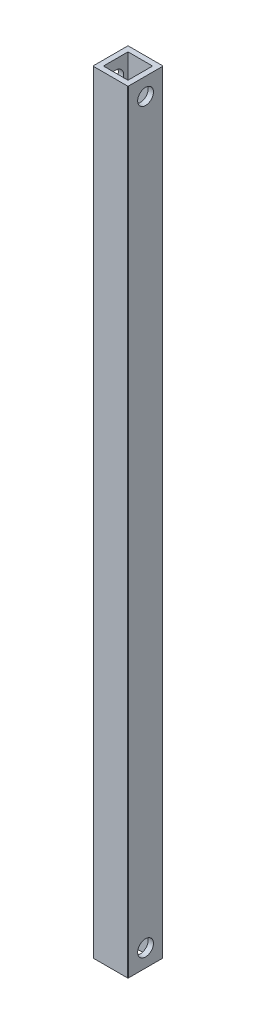
ISO-10303-21;
HEADER;
FILE_DESCRIPTION(('STEP AP214'),'2;1');
FILE_NAME('part.step','',(''),(''),'','','');
FILE_SCHEMA(('AUTOMOTIVE_DESIGN { 1 0 10303 214 1 1 1 1 }'));
ENDSEC;
DATA;
#1=APPLICATION_CONTEXT('core data for automotive mechanical design processes');
#2=APPLICATION_PROTOCOL_DEFINITION('international standard','automotive_design',2000,#1);
#3=PRODUCT_CONTEXT('',#1,'mechanical');
#4=PRODUCT('Part','Part','',(#3));
#5=PRODUCT_RELATED_PRODUCT_CATEGORY('part','',(#4));
#6=PRODUCT_DEFINITION_FORMATION('','',#4);
#7=PRODUCT_DEFINITION_CONTEXT('part definition',#1,'design');
#8=PRODUCT_DEFINITION('design','',#6,#7);
#9=PRODUCT_DEFINITION_SHAPE('','',#8);
#10=(LENGTH_UNIT() NAMED_UNIT(*) SI_UNIT(.MILLI.,.METRE.));
#11=(NAMED_UNIT(*) PLANE_ANGLE_UNIT() SI_UNIT($,.RADIAN.));
#12=(NAMED_UNIT(*) SI_UNIT($,.STERADIAN.) SOLID_ANGLE_UNIT());
#13=UNCERTAINTY_MEASURE_WITH_UNIT(LENGTH_MEASURE(1.E-05),#10,'distance_accuracy_value','');
#14=(GEOMETRIC_REPRESENTATION_CONTEXT(3) GLOBAL_UNCERTAINTY_ASSIGNED_CONTEXT((#13)) GLOBAL_UNIT_ASSIGNED_CONTEXT((#10,
#11,#12)) REPRESENTATION_CONTEXT('',''));
#15=CARTESIAN_POINT('',(0.,0.,0.));
#16=DIRECTION('',(0.,0.,1.));
#17=DIRECTION('',(1.,0.,0.));
#18=AXIS2_PLACEMENT_3D('',#15,#16,#17);
#19=CARTESIAN_POINT('',(0.,220.,0.));
#20=DIRECTION('',(0.,1.,0.));
#21=DIRECTION('',(0.,0.,1.));
#22=AXIS2_PLACEMENT_3D('',#19,#20,#21);
#23=PLANE('',#22);
#24=DIRECTION('',(0.,0.,1.));
#25=VECTOR('',#24,1.);
#26=CARTESIAN_POINT('',(-5.,220.,5.));
#27=LINE('',#26,#25);
#28=CARTESIAN_POINT('',(-5.,220.,-4.8));
#29=VERTEX_POINT('',#28);
#30=CARTESIAN_POINT('',(-5.,220.,4.8));
#31=VERTEX_POINT('',#30);
#32=EDGE_CURVE('E211',#29,#31,#27,.T.);
#33=ORIENTED_EDGE('',*,*,#32,.T.);
#34=CARTESIAN_POINT('',(-4.8,220.,4.8));
#35=DIRECTION('',(0.,1.,0.));
#36=DIRECTION('',(0.,0.,1.));
#37=AXIS2_PLACEMENT_3D('',#34,#35,#36);
#38=CIRCLE('',#37,0.2);
#39=CARTESIAN_POINT('',(-4.8,220.,5.));
#40=VERTEX_POINT('',#39);
#41=EDGE_CURVE('E283',#31,#40,#38,.T.);
#42=ORIENTED_EDGE('',*,*,#41,.T.);
#43=DIRECTION('',(1.,0.,0.));
#44=VECTOR('',#43,1.);
#45=CARTESIAN_POINT('',(5.,220.,5.));
#46=LINE('',#45,#44);
#47=CARTESIAN_POINT('',(4.8,220.,5.));
#48=VERTEX_POINT('',#47);
#49=EDGE_CURVE('E215',#40,#48,#46,.T.);
#50=ORIENTED_EDGE('',*,*,#49,.T.);
#51=CARTESIAN_POINT('',(4.8,220.,4.8));
#52=DIRECTION('',(0.,1.,0.));
#53=DIRECTION('',(0.,0.,1.));
#54=AXIS2_PLACEMENT_3D('',#51,#52,#53);
#55=CIRCLE('',#54,0.2);
#56=CARTESIAN_POINT('',(5.,220.,4.8));
#57=VERTEX_POINT('',#56);
#58=EDGE_CURVE('E280',#48,#57,#55,.T.);
#59=ORIENTED_EDGE('',*,*,#58,.T.);
#60=DIRECTION('',(0.,0.,-1.));
#61=VECTOR('',#60,1.);
#62=CARTESIAN_POINT('',(5.,220.,5.));
#63=LINE('',#62,#61);
#64=CARTESIAN_POINT('',(5.,220.,-4.8));
#65=VERTEX_POINT('',#64);
#66=EDGE_CURVE('E220',#57,#65,#63,.T.);
#67=ORIENTED_EDGE('',*,*,#66,.T.);
#68=CARTESIAN_POINT('',(4.8,220.,-4.8));
#69=DIRECTION('',(0.,1.,0.));
#70=DIRECTION('',(0.,0.,1.));
#71=AXIS2_PLACEMENT_3D('',#68,#69,#70);
#72=CIRCLE('',#71,0.2);
#73=CARTESIAN_POINT('',(4.8,220.,-5.));
#74=VERTEX_POINT('',#73);
#75=EDGE_CURVE('E86',#65,#74,#72,.T.);
#76=ORIENTED_EDGE('',*,*,#75,.T.);
#77=DIRECTION('',(-1.,0.,0.));
#78=VECTOR('',#77,1.);
#79=CARTESIAN_POINT('',(5.,220.,-5.));
#80=LINE('',#79,#78);
#81=CARTESIAN_POINT('',(-4.8,220.,-5.));
#82=VERTEX_POINT('',#81);
#83=EDGE_CURVE('E223',#74,#82,#80,.T.);
#84=ORIENTED_EDGE('',*,*,#83,.T.);
#85=CARTESIAN_POINT('',(-4.8,220.,-4.8));
#86=DIRECTION('',(0.,1.,0.));
#87=DIRECTION('',(0.,0.,1.));
#88=AXIS2_PLACEMENT_3D('',#85,#86,#87);
#89=CIRCLE('',#88,0.2);
#90=EDGE_CURVE('E277',#82,#29,#89,.T.);
#91=ORIENTED_EDGE('',*,*,#90,.T.);
#92=EDGE_LOOP('',(#33,#42,#50,#59,#67,#76,#84,#91));
#93=FACE_BOUND('',#92,.T.);
#94=DIRECTION('',(1.,0.,0.));
#95=VECTOR('',#94,1.);
#96=CARTESIAN_POINT('',(5.,220.,3.5));
#97=LINE('',#96,#95);
#98=CARTESIAN_POINT('',(-3.5,220.,3.5));
#99=VERTEX_POINT('',#98);
#100=CARTESIAN_POINT('',(3.5,220.,3.5));
#101=VERTEX_POINT('',#100);
#102=EDGE_CURVE('E167',#99,#101,#97,.T.);
#103=ORIENTED_EDGE('',*,*,#102,.F.);
#104=DIRECTION('',(0.,0.,1.));
#105=VECTOR('',#104,1.);
#106=CARTESIAN_POINT('',(-3.5,220.,5.));
#107=LINE('',#106,#105);
#108=CARTESIAN_POINT('',(-3.5,220.,-3.5));
#109=VERTEX_POINT('',#108);
#110=EDGE_CURVE('E156',#109,#99,#107,.T.);
#111=ORIENTED_EDGE('',*,*,#110,.F.);
#112=DIRECTION('',(-1.,0.,0.));
#113=VECTOR('',#112,1.);
#114=CARTESIAN_POINT('',(5.,220.,-3.5));
#115=LINE('',#114,#113);
#116=CARTESIAN_POINT('',(3.5,220.,-3.5));
#117=VERTEX_POINT('',#116);
#118=EDGE_CURVE('E185',#117,#109,#115,.T.);
#119=ORIENTED_EDGE('',*,*,#118,.F.);
#120=DIRECTION('',(0.,0.,-1.));
#121=VECTOR('',#120,1.);
#122=CARTESIAN_POINT('',(3.5,220.,5.));
#123=LINE('',#122,#121);
#124=EDGE_CURVE('E181',#101,#117,#123,.T.);
#125=ORIENTED_EDGE('',*,*,#124,.F.);
#126=EDGE_LOOP('',(#103,#111,#119,#125));
#127=FACE_BOUND('',#126,.T.);
#128=ADVANCED_FACE('F65',(#93,#127),#23,.T.);
#129=CARTESIAN_POINT('',(0.,0.,0.));
#130=DIRECTION('',(0.,1.,0.));
#131=DIRECTION('',(0.,0.,1.));
#132=AXIS2_PLACEMENT_3D('',#129,#130,#131);
#133=PLANE('',#132);
#134=DIRECTION('',(1.,0.,0.));
#135=VECTOR('',#134,1.);
#136=CARTESIAN_POINT('',(5.,0.,5.));
#137=LINE('',#136,#135);
#138=CARTESIAN_POINT('',(-4.8,0.,5.));
#139=VERTEX_POINT('',#138);
#140=CARTESIAN_POINT('',(4.8,0.,5.));
#141=VERTEX_POINT('',#140);
#142=EDGE_CURVE('E230',#139,#141,#137,.T.);
#143=ORIENTED_EDGE('',*,*,#142,.F.);
#144=CARTESIAN_POINT('',(-4.8,0.,4.8));
#145=DIRECTION('',(0.,1.,0.));
#146=DIRECTION('',(0.,0.,1.));
#147=AXIS2_PLACEMENT_3D('',#144,#145,#146);
#148=CIRCLE('',#147,0.2);
#149=CARTESIAN_POINT('',(-5.,0.,4.8));
#150=VERTEX_POINT('',#149);
#151=EDGE_CURVE('E265',#139,#150,#148,.F.);
#152=ORIENTED_EDGE('',*,*,#151,.T.);
#153=DIRECTION('',(0.,0.,1.));
#154=VECTOR('',#153,1.);
#155=CARTESIAN_POINT('',(-5.,0.,5.));
#156=LINE('',#155,#154);
#157=CARTESIAN_POINT('',(-5.,0.,-4.8));
#158=VERTEX_POINT('',#157);
#159=EDGE_CURVE('E176',#158,#150,#156,.T.);
#160=ORIENTED_EDGE('',*,*,#159,.F.);
#161=CARTESIAN_POINT('',(-4.8,0.,-4.8));
#162=DIRECTION('',(0.,1.,0.));
#163=DIRECTION('',(0.,0.,1.));
#164=AXIS2_PLACEMENT_3D('',#161,#162,#163);
#165=CIRCLE('',#164,0.2);
#166=CARTESIAN_POINT('',(-4.8,0.,-5.));
#167=VERTEX_POINT('',#166);
#168=EDGE_CURVE('E259',#158,#167,#165,.F.);
#169=ORIENTED_EDGE('',*,*,#168,.T.);
#170=DIRECTION('',(-1.,0.,0.));
#171=VECTOR('',#170,1.);
#172=CARTESIAN_POINT('',(5.,0.,-5.));
#173=LINE('',#172,#171);
#174=CARTESIAN_POINT('',(4.8,0.,-5.));
#175=VERTEX_POINT('',#174);
#176=EDGE_CURVE('E216',#175,#167,#173,.T.);
#177=ORIENTED_EDGE('',*,*,#176,.F.);
#178=CARTESIAN_POINT('',(4.8,0.,-4.8));
#179=DIRECTION('',(0.,1.,0.));
#180=DIRECTION('',(0.,0.,1.));
#181=AXIS2_PLACEMENT_3D('',#178,#179,#180);
#182=CIRCLE('',#181,0.2);
#183=CARTESIAN_POINT('',(5.,0.,-4.8));
#184=VERTEX_POINT('',#183);
#185=EDGE_CURVE('E256',#175,#184,#182,.F.);
#186=ORIENTED_EDGE('',*,*,#185,.T.);
#187=DIRECTION('',(0.,0.,-1.));
#188=VECTOR('',#187,1.);
#189=CARTESIAN_POINT('',(5.,0.,5.));
#190=LINE('',#189,#188);
#191=CARTESIAN_POINT('',(5.,0.,4.8));
#192=VERTEX_POINT('',#191);
#193=EDGE_CURVE('E234',#192,#184,#190,.T.);
#194=ORIENTED_EDGE('',*,*,#193,.F.);
#195=CARTESIAN_POINT('',(4.8,0.,4.8));
#196=DIRECTION('',(0.,1.,0.));
#197=DIRECTION('',(0.,0.,1.));
#198=AXIS2_PLACEMENT_3D('',#195,#196,#197);
#199=CIRCLE('',#198,0.2);
#200=EDGE_CURVE('E262',#192,#141,#199,.F.);
#201=ORIENTED_EDGE('',*,*,#200,.T.);
#202=EDGE_LOOP('',(#143,#152,#160,#169,#177,#186,#194,#201));
#203=FACE_BOUND('',#202,.T.);
#204=DIRECTION('',(0.,0.,1.));
#205=VECTOR('',#204,1.);
#206=CARTESIAN_POINT('',(-3.5,0.,5.));
#207=LINE('',#206,#205);
#208=CARTESIAN_POINT('',(-3.5,0.,-3.5));
#209=VERTEX_POINT('',#208);
#210=CARTESIAN_POINT('',(-3.5,0.,3.5));
#211=VERTEX_POINT('',#210);
#212=EDGE_CURVE('E191',#209,#211,#207,.T.);
#213=ORIENTED_EDGE('',*,*,#212,.T.);
#214=DIRECTION('',(1.,0.,0.));
#215=VECTOR('',#214,1.);
#216=CARTESIAN_POINT('',(5.,0.,3.5));
#217=LINE('',#216,#215);
#218=CARTESIAN_POINT('',(3.5,0.,3.5));
#219=VERTEX_POINT('',#218);
#220=EDGE_CURVE('E174',#211,#219,#217,.T.);
#221=ORIENTED_EDGE('',*,*,#220,.T.);
#222=DIRECTION('',(0.,0.,-1.));
#223=VECTOR('',#222,1.);
#224=CARTESIAN_POINT('',(3.5,0.,5.));
#225=LINE('',#224,#223);
#226=CARTESIAN_POINT('',(3.5,0.,-3.5));
#227=VERTEX_POINT('',#226);
#228=EDGE_CURVE('E197',#219,#227,#225,.T.);
#229=ORIENTED_EDGE('',*,*,#228,.T.);
#230=DIRECTION('',(-1.,0.,0.));
#231=VECTOR('',#230,1.);
#232=CARTESIAN_POINT('',(5.,0.,-3.5));
#233=LINE('',#232,#231);
#234=EDGE_CURVE('E168',#227,#209,#233,.T.);
#235=ORIENTED_EDGE('',*,*,#234,.T.);
#236=EDGE_LOOP('',(#213,#221,#229,#235));
#237=FACE_BOUND('',#236,.T.);
#238=ADVANCED_FACE('F300',(#203,#237),#133,.F.);
#239=CARTESIAN_POINT('',(-5.,220.,5.));
#240=DIRECTION('',(1.,0.,0.));
#241=DIRECTION('',(0.,0.,-1.));
#242=AXIS2_PLACEMENT_3D('',#239,#240,#241);
#243=PLANE('',#242);
#244=CARTESIAN_POINT('',(-5.,215.,0.));
#245=DIRECTION('',(1.,0.,0.));
#246=DIRECTION('',(0.,0.,-1.));
#247=AXIS2_PLACEMENT_3D('',#244,#245,#246);
#248=CIRCLE('',#247,2.25);
#249=CARTESIAN_POINT('',(-5.,215.,-2.25));
#250=VERTEX_POINT('',#249);
#251=EDGE_CURVE('E245',#250,#250,#248,.T.);
#252=ORIENTED_EDGE('',*,*,#251,.T.);
#253=EDGE_LOOP('',(#252));
#254=FACE_BOUND('',#253,.T.);
#255=CARTESIAN_POINT('',(-5.,5.,0.));
#256=DIRECTION('',(1.,0.,0.));
#257=DIRECTION('',(0.,0.,1.));
#258=AXIS2_PLACEMENT_3D('',#255,#256,#257);
#259=CIRCLE('',#258,2.25);
#260=CARTESIAN_POINT('',(-5.,5.,2.25));
#261=VERTEX_POINT('',#260);
#262=EDGE_CURVE('E491',#261,#261,#259,.T.);
#263=ORIENTED_EDGE('',*,*,#262,.T.);
#264=EDGE_LOOP('',(#263));
#265=FACE_BOUND('',#264,.T.);
#266=ORIENTED_EDGE('',*,*,#159,.T.);
#267=DIRECTION('',(0.,-1.,0.));
#268=VECTOR('',#267,1.);
#269=CARTESIAN_POINT('',(-5.,220.,4.8));
#270=LINE('',#269,#268);
#271=EDGE_CURVE('E272',#150,#31,#270,.F.);
#272=ORIENTED_EDGE('',*,*,#271,.T.);
#273=ORIENTED_EDGE('',*,*,#32,.F.);
#274=DIRECTION('',(0.,-1.,0.));
#275=VECTOR('',#274,1.);
#276=CARTESIAN_POINT('',(-5.,220.,-4.8));
#277=LINE('',#276,#275);
#278=EDGE_CURVE('E268',#29,#158,#277,.T.);
#279=ORIENTED_EDGE('',*,*,#278,.T.);
#280=EDGE_LOOP('',(#266,#272,#273,#279));
#281=FACE_BOUND('',#280,.T.);
#282=ADVANCED_FACE('F310',(#254,#265,#281),#243,.F.);
#283=CARTESIAN_POINT('',(5.,220.,5.));
#284=DIRECTION('',(0.,0.,-1.));
#285=DIRECTION('',(-1.,0.,0.));
#286=AXIS2_PLACEMENT_3D('',#283,#284,#285);
#287=PLANE('',#286);
#288=ORIENTED_EDGE('',*,*,#49,.F.);
#289=DIRECTION('',(0.,-1.,0.));
#290=VECTOR('',#289,1.);
#291=CARTESIAN_POINT('',(-4.8,220.,5.));
#292=LINE('',#291,#290);
#293=EDGE_CURVE('E252',#40,#139,#292,.T.);
#294=ORIENTED_EDGE('',*,*,#293,.T.);
#295=ORIENTED_EDGE('',*,*,#142,.T.);
#296=DIRECTION('',(0.,-1.,0.));
#297=VECTOR('',#296,1.);
#298=CARTESIAN_POINT('',(4.8,220.,5.));
#299=LINE('',#298,#297);
#300=EDGE_CURVE('E226',#141,#48,#299,.F.);
#301=ORIENTED_EDGE('',*,*,#300,.T.);
#302=EDGE_LOOP('',(#288,#294,#295,#301));
#303=FACE_BOUND('',#302,.T.);
#304=ADVANCED_FACE('F318',(#303),#287,.F.);
#305=CARTESIAN_POINT('',(5.,220.,5.));
#306=DIRECTION('',(-1.,0.,0.));
#307=DIRECTION('',(0.,0.,1.));
#308=AXIS2_PLACEMENT_3D('',#305,#306,#307);
#309=PLANE('',#308);
#310=CARTESIAN_POINT('',(5.,215.,0.));
#311=DIRECTION('',(1.,0.,0.));
#312=DIRECTION('',(0.,0.,-1.));
#313=AXIS2_PLACEMENT_3D('',#310,#311,#312);
#314=CIRCLE('',#313,2.25);
#315=CARTESIAN_POINT('',(5.,215.,-2.25));
#316=VERTEX_POINT('',#315);
#317=EDGE_CURVE('E498',#316,#316,#314,.T.);
#318=ORIENTED_EDGE('',*,*,#317,.F.);
#319=EDGE_LOOP('',(#318));
#320=FACE_BOUND('',#319,.T.);
#321=CARTESIAN_POINT('',(5.,5.,0.));
#322=DIRECTION('',(1.,0.,0.));
#323=DIRECTION('',(0.,0.,1.));
#324=AXIS2_PLACEMENT_3D('',#321,#322,#323);
#325=CIRCLE('',#324,2.25);
#326=CARTESIAN_POINT('',(5.,5.,2.25));
#327=VERTEX_POINT('',#326);
#328=EDGE_CURVE('E503',#327,#327,#325,.T.);
#329=ORIENTED_EDGE('',*,*,#328,.F.);
#330=EDGE_LOOP('',(#329));
#331=FACE_BOUND('',#330,.T.);
#332=ORIENTED_EDGE('',*,*,#66,.F.);
#333=DIRECTION('',(0.,-1.,0.));
#334=VECTOR('',#333,1.);
#335=CARTESIAN_POINT('',(5.,220.,4.8));
#336=LINE('',#335,#334);
#337=EDGE_CURVE('E289',#57,#192,#336,.T.);
#338=ORIENTED_EDGE('',*,*,#337,.T.);
#339=ORIENTED_EDGE('',*,*,#193,.T.);
#340=DIRECTION('',(0.,-1.,0.));
#341=VECTOR('',#340,1.);
#342=CARTESIAN_POINT('',(5.,220.,-4.8));
#343=LINE('',#342,#341);
#344=EDGE_CURVE('E286',#184,#65,#343,.F.);
#345=ORIENTED_EDGE('',*,*,#344,.T.);
#346=EDGE_LOOP('',(#332,#338,#339,#345));
#347=FACE_BOUND('',#346,.T.);
#348=ADVANCED_FACE('F326',(#320,#331,#347),#309,.F.);
#349=CARTESIAN_POINT('',(5.,220.,-5.));
#350=DIRECTION('',(0.,0.,1.));
#351=DIRECTION('',(1.,0.,0.));
#352=AXIS2_PLACEMENT_3D('',#349,#350,#351);
#353=PLANE('',#352);
#354=ORIENTED_EDGE('',*,*,#176,.T.);
#355=DIRECTION('',(0.,-1.,0.));
#356=VECTOR('',#355,1.);
#357=CARTESIAN_POINT('',(-4.8,220.,-5.));
#358=LINE('',#357,#356);
#359=EDGE_CURVE('E12',#167,#82,#358,.F.);
#360=ORIENTED_EDGE('',*,*,#359,.T.);
#361=ORIENTED_EDGE('',*,*,#83,.F.);
#362=DIRECTION('',(0.,-1.,0.));
#363=VECTOR('',#362,1.);
#364=CARTESIAN_POINT('',(4.8,220.,-5.));
#365=LINE('',#364,#363);
#366=EDGE_CURVE('E74',#74,#175,#365,.T.);
#367=ORIENTED_EDGE('',*,*,#366,.T.);
#368=EDGE_LOOP('',(#354,#360,#361,#367));
#369=FACE_BOUND('',#368,.T.);
#370=ADVANCED_FACE('F296',(#369),#353,.F.);
#371=CARTESIAN_POINT('',(-3.5,220.,5.));
#372=DIRECTION('',(1.,0.,0.));
#373=DIRECTION('',(0.,0.,-1.));
#374=AXIS2_PLACEMENT_3D('',#371,#372,#373);
#375=PLANE('',#374);
#376=CARTESIAN_POINT('',(-3.5,215.,0.));
#377=DIRECTION('',(1.,0.,0.));
#378=DIRECTION('',(0.,0.,-1.));
#379=AXIS2_PLACEMENT_3D('',#376,#377,#378);
#380=CIRCLE('',#379,2.25);
#381=CARTESIAN_POINT('',(-3.5,215.,-2.25));
#382=VERTEX_POINT('',#381);
#383=EDGE_CURVE('E194',#382,#382,#380,.T.);
#384=ORIENTED_EDGE('',*,*,#383,.F.);
#385=EDGE_LOOP('',(#384));
#386=FACE_BOUND('',#385,.T.);
#387=CARTESIAN_POINT('',(-3.5,5.,0.));
#388=DIRECTION('',(1.,0.,0.));
#389=DIRECTION('',(0.,0.,-1.));
#390=AXIS2_PLACEMENT_3D('',#387,#388,#389);
#391=CIRCLE('',#390,2.25);
#392=CARTESIAN_POINT('',(-3.5,5.,-2.25));
#393=VERTEX_POINT('',#392);
#394=EDGE_CURVE('E244',#393,#393,#391,.T.);
#395=ORIENTED_EDGE('',*,*,#394,.F.);
#396=EDGE_LOOP('',(#395));
#397=FACE_BOUND('',#396,.T.);
#398=ORIENTED_EDGE('',*,*,#212,.F.);
#399=DIRECTION('',(0.,-1.,0.));
#400=VECTOR('',#399,1.);
#401=CARTESIAN_POINT('',(-3.5,220.,-3.5));
#402=LINE('',#401,#400);
#403=EDGE_CURVE('E162',#109,#209,#402,.T.);
#404=ORIENTED_EDGE('',*,*,#403,.F.);
#405=ORIENTED_EDGE('',*,*,#110,.T.);
#406=DIRECTION('',(0.,-1.,0.));
#407=VECTOR('',#406,1.);
#408=CARTESIAN_POINT('',(-3.5,220.,3.5));
#409=LINE('',#408,#407);
#410=EDGE_CURVE('E159',#99,#211,#409,.T.);
#411=ORIENTED_EDGE('',*,*,#410,.T.);
#412=EDGE_LOOP('',(#398,#404,#405,#411));
#413=FACE_BOUND('',#412,.T.);
#414=ADVANCED_FACE('F158',(#386,#397,#413),#375,.T.);
#415=CARTESIAN_POINT('',(5.,220.,3.5));
#416=DIRECTION('',(0.,0.,-1.));
#417=DIRECTION('',(-1.,0.,0.));
#418=AXIS2_PLACEMENT_3D('',#415,#416,#417);
#419=PLANE('',#418);
#420=ORIENTED_EDGE('',*,*,#220,.F.);
#421=ORIENTED_EDGE('',*,*,#410,.F.);
#422=ORIENTED_EDGE('',*,*,#102,.T.);
#423=DIRECTION('',(0.,-1.,0.));
#424=VECTOR('',#423,1.);
#425=CARTESIAN_POINT('',(3.5,220.,3.5));
#426=LINE('',#425,#424);
#427=EDGE_CURVE('E177',#101,#219,#426,.T.);
#428=ORIENTED_EDGE('',*,*,#427,.T.);
#429=EDGE_LOOP('',(#420,#421,#422,#428));
#430=FACE_BOUND('',#429,.T.);
#431=ADVANCED_FACE('F171',(#430),#419,.T.);
#432=CARTESIAN_POINT('',(3.5,220.,5.));
#433=DIRECTION('',(-1.,0.,0.));
#434=DIRECTION('',(0.,0.,1.));
#435=AXIS2_PLACEMENT_3D('',#432,#433,#434);
#436=PLANE('',#435);
#437=CARTESIAN_POINT('',(3.5,215.,0.));
#438=DIRECTION('',(-1.,0.,0.));
#439=DIRECTION('',(0.,0.,1.));
#440=AXIS2_PLACEMENT_3D('',#437,#438,#439);
#441=CIRCLE('',#440,2.25);
#442=CARTESIAN_POINT('',(3.5,215.,2.25));
#443=VERTEX_POINT('',#442);
#444=EDGE_CURVE('E246',#443,#443,#441,.T.);
#445=ORIENTED_EDGE('',*,*,#444,.F.);
#446=EDGE_LOOP('',(#445));
#447=FACE_BOUND('',#446,.T.);
#448=CARTESIAN_POINT('',(3.5,5.,0.));
#449=DIRECTION('',(-1.,0.,0.));
#450=DIRECTION('',(0.,0.,1.));
#451=AXIS2_PLACEMENT_3D('',#448,#449,#450);
#452=CIRCLE('',#451,2.25);
#453=CARTESIAN_POINT('',(3.5,5.,2.25));
#454=VERTEX_POINT('',#453);
#455=EDGE_CURVE('E240',#454,#454,#452,.T.);
#456=ORIENTED_EDGE('',*,*,#455,.F.);
#457=EDGE_LOOP('',(#456));
#458=FACE_BOUND('',#457,.T.);
#459=ORIENTED_EDGE('',*,*,#228,.F.);
#460=ORIENTED_EDGE('',*,*,#427,.F.);
#461=ORIENTED_EDGE('',*,*,#124,.T.);
#462=DIRECTION('',(0.,-1.,0.));
#463=VECTOR('',#462,1.);
#464=CARTESIAN_POINT('',(3.5,220.,-3.5));
#465=LINE('',#464,#463);
#466=EDGE_CURVE('E206',#117,#227,#465,.T.);
#467=ORIENTED_EDGE('',*,*,#466,.T.);
#468=EDGE_LOOP('',(#459,#460,#461,#467));
#469=FACE_BOUND('',#468,.T.);
#470=ADVANCED_FACE('F419',(#447,#458,#469),#436,.T.);
#471=CARTESIAN_POINT('',(5.,220.,-3.5));
#472=DIRECTION('',(0.,0.,1.));
#473=DIRECTION('',(1.,0.,0.));
#474=AXIS2_PLACEMENT_3D('',#471,#472,#473);
#475=PLANE('',#474);
#476=ORIENTED_EDGE('',*,*,#234,.F.);
#477=ORIENTED_EDGE('',*,*,#466,.F.);
#478=ORIENTED_EDGE('',*,*,#118,.T.);
#479=ORIENTED_EDGE('',*,*,#403,.T.);
#480=EDGE_LOOP('',(#476,#477,#478,#479));
#481=FACE_BOUND('',#480,.T.);
#482=ADVANCED_FACE('F410',(#481),#475,.T.);
#483=CARTESIAN_POINT('',(-5.,5.,0.));
#484=DIRECTION('',(1.,0.,0.));
#485=DIRECTION('',(0.,0.,-1.));
#486=AXIS2_PLACEMENT_3D('',#483,#484,#485);
#487=CYLINDRICAL_SURFACE('',#486,2.25);
#488=ORIENTED_EDGE('',*,*,#455,.T.);
#489=EDGE_LOOP('',(#488));
#490=FACE_BOUND('',#489,.T.);
#491=ORIENTED_EDGE('',*,*,#328,.T.);
#492=EDGE_LOOP('',(#491));
#493=FACE_BOUND('',#492,.T.);
#494=ADVANCED_FACE('F396',(#490,#493),#487,.F.);
#495=CARTESIAN_POINT('',(-5.,215.,0.));
#496=DIRECTION('',(1.,0.,0.));
#497=DIRECTION('',(0.,0.,-1.));
#498=AXIS2_PLACEMENT_3D('',#495,#496,#497);
#499=CYLINDRICAL_SURFACE('',#498,2.25);
#500=ORIENTED_EDGE('',*,*,#444,.T.);
#501=EDGE_LOOP('',(#500));
#502=FACE_BOUND('',#501,.T.);
#503=ORIENTED_EDGE('',*,*,#317,.T.);
#504=EDGE_LOOP('',(#503));
#505=FACE_BOUND('',#504,.T.);
#506=ADVANCED_FACE('F387',(#502,#505),#499,.F.);
#507=ORIENTED_EDGE('',*,*,#394,.T.);
#508=EDGE_LOOP('',(#507));
#509=FACE_BOUND('',#508,.T.);
#510=ORIENTED_EDGE('',*,*,#262,.F.);
#511=EDGE_LOOP('',(#510));
#512=FACE_BOUND('',#511,.T.);
#513=ADVANCED_FACE('F384',(#509,#512),#487,.F.);
#514=ORIENTED_EDGE('',*,*,#383,.T.);
#515=EDGE_LOOP('',(#514));
#516=FACE_BOUND('',#515,.T.);
#517=ORIENTED_EDGE('',*,*,#251,.F.);
#518=EDGE_LOOP('',(#517));
#519=FACE_BOUND('',#518,.T.);
#520=ADVANCED_FACE('F353',(#516,#519),#499,.F.);
#521=CARTESIAN_POINT('',(-4.8,220.,4.8));
#522=DIRECTION('',(0.,-1.,0.));
#523=DIRECTION('',(0.,0.,-1.));
#524=AXIS2_PLACEMENT_3D('',#521,#522,#523);
#525=CYLINDRICAL_SURFACE('',#524,0.2);
#526=ORIENTED_EDGE('',*,*,#41,.F.);
#527=ORIENTED_EDGE('',*,*,#271,.F.);
#528=ORIENTED_EDGE('',*,*,#151,.F.);
#529=ORIENTED_EDGE('',*,*,#293,.F.);
#530=EDGE_LOOP('',(#526,#527,#528,#529));
#531=FACE_BOUND('',#530,.T.);
#532=ADVANCED_FACE('F316',(#531),#525,.T.);
#533=CARTESIAN_POINT('',(4.8,220.,4.8));
#534=DIRECTION('',(0.,-1.,0.));
#535=DIRECTION('',(0.,0.,-1.));
#536=AXIS2_PLACEMENT_3D('',#533,#534,#535);
#537=CYLINDRICAL_SURFACE('',#536,0.2);
#538=ORIENTED_EDGE('',*,*,#58,.F.);
#539=ORIENTED_EDGE('',*,*,#300,.F.);
#540=ORIENTED_EDGE('',*,*,#200,.F.);
#541=ORIENTED_EDGE('',*,*,#337,.F.);
#542=EDGE_LOOP('',(#538,#539,#540,#541));
#543=FACE_BOUND('',#542,.T.);
#544=ADVANCED_FACE('F323',(#543),#537,.T.);
#545=CARTESIAN_POINT('',(-4.8,220.,-4.8));
#546=DIRECTION('',(0.,-1.,0.));
#547=DIRECTION('',(0.,0.,-1.));
#548=AXIS2_PLACEMENT_3D('',#545,#546,#547);
#549=CYLINDRICAL_SURFACE('',#548,0.2);
#550=ORIENTED_EDGE('',*,*,#90,.F.);
#551=ORIENTED_EDGE('',*,*,#359,.F.);
#552=ORIENTED_EDGE('',*,*,#168,.F.);
#553=ORIENTED_EDGE('',*,*,#278,.F.);
#554=EDGE_LOOP('',(#550,#551,#552,#553));
#555=FACE_BOUND('',#554,.T.);
#556=ADVANCED_FACE('F307',(#555),#549,.T.);
#557=CARTESIAN_POINT('',(4.8,220.,-4.8));
#558=DIRECTION('',(0.,-1.,0.));
#559=DIRECTION('',(0.,0.,-1.));
#560=AXIS2_PLACEMENT_3D('',#557,#558,#559);
#561=CYLINDRICAL_SURFACE('',#560,0.2);
#562=ORIENTED_EDGE('',*,*,#75,.F.);
#563=ORIENTED_EDGE('',*,*,#344,.F.);
#564=ORIENTED_EDGE('',*,*,#185,.F.);
#565=ORIENTED_EDGE('',*,*,#366,.F.);
#566=EDGE_LOOP('',(#562,#563,#564,#565));
#567=FACE_BOUND('',#566,.T.);
#568=ADVANCED_FACE('F67',(#567),#561,.T.);
#569=CLOSED_SHELL('',(#128,#238,#282,#304,#348,#370,#414,#431,#470,#482,#494,#506,#513,#520,
#532,#544,#556,#568));
#570=MANIFOLD_SOLID_BREP('B2',#569);
#571=ADVANCED_BREP_SHAPE_REPRESENTATION('',(#18,#570),#14);
#572=SHAPE_DEFINITION_REPRESENTATION(#9,#571);
ENDSEC;
END-ISO-10303-21;
